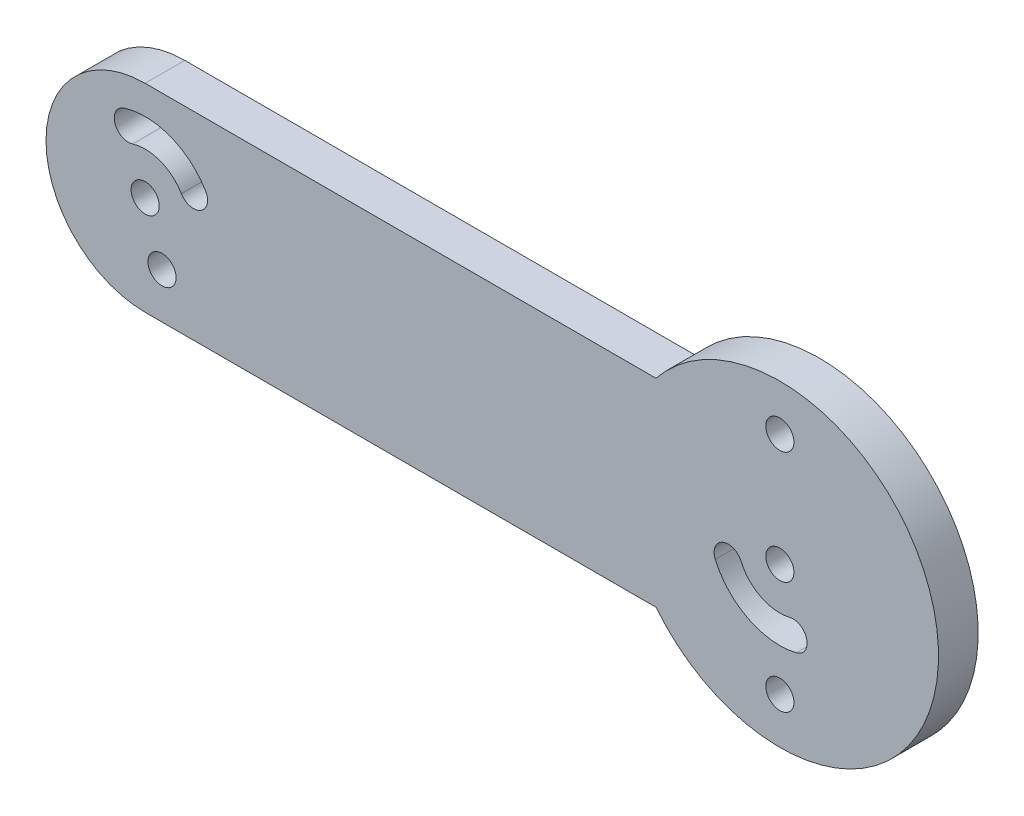
ISO-10303-21;
HEADER;
FILE_DESCRIPTION(('STEP AP214'),'2;1');
FILE_NAME('part.step','',(''),(''),'','','');
FILE_SCHEMA(('AUTOMOTIVE_DESIGN { 1 0 10303 214 1 1 1 1 }'));
ENDSEC;
DATA;
#1=APPLICATION_CONTEXT('core data for automotive mechanical design processes');
#2=APPLICATION_PROTOCOL_DEFINITION('international standard','automotive_design',2000,#1);
#3=PRODUCT_CONTEXT('',#1,'mechanical');
#4=PRODUCT('Part','Part','',(#3));
#5=PRODUCT_RELATED_PRODUCT_CATEGORY('part','',(#4));
#6=PRODUCT_DEFINITION_FORMATION('','',#4);
#7=PRODUCT_DEFINITION_CONTEXT('part definition',#1,'design');
#8=PRODUCT_DEFINITION('design','',#6,#7);
#9=PRODUCT_DEFINITION_SHAPE('','',#8);
#10=(LENGTH_UNIT() NAMED_UNIT(*) SI_UNIT(.MILLI.,.METRE.));
#11=(NAMED_UNIT(*) PLANE_ANGLE_UNIT() SI_UNIT($,.RADIAN.));
#12=(NAMED_UNIT(*) SI_UNIT($,.STERADIAN.) SOLID_ANGLE_UNIT());
#13=UNCERTAINTY_MEASURE_WITH_UNIT(LENGTH_MEASURE(1.E-05),#10,'distance_accuracy_value','');
#14=(GEOMETRIC_REPRESENTATION_CONTEXT(3) GLOBAL_UNCERTAINTY_ASSIGNED_CONTEXT((#13)) GLOBAL_UNIT_ASSIGNED_CONTEXT((#10,
#11,#12)) REPRESENTATION_CONTEXT('',''));
#15=CARTESIAN_POINT('',(0.,0.,0.));
#16=DIRECTION('',(0.,0.,1.));
#17=DIRECTION('',(1.,0.,0.));
#18=AXIS2_PLACEMENT_3D('',#15,#16,#17);
#19=CARTESIAN_POINT('',(-40.,-2.79318507107451E-13,2.5));
#20=DIRECTION('',(0.,0.,1.));
#21=DIRECTION('',(1.,0.,0.));
#22=AXIS2_PLACEMENT_3D('',#19,#20,#21);
#23=PLANE('',#22);
#24=CARTESIAN_POINT('',(0.,-7.1,2.5));
#25=DIRECTION('',(0.,0.,1.));
#26=DIRECTION('',(-1.,0.,0.));
#27=AXIS2_PLACEMENT_3D('',#24,#25,#26);
#28=CIRCLE('',#27,0.8875);
#29=CARTESIAN_POINT('',(-0.887499999999971,-7.1,2.5));
#30=VERTEX_POINT('',#29);
#31=EDGE_CURVE('E357',#30,#30,#28,.T.);
#32=ORIENTED_EDGE('',*,*,#31,.F.);
#33=EDGE_LOOP('',(#32));
#34=FACE_BOUND('',#33,.T.);
#35=CARTESIAN_POINT('',(-40.,-2.79318507107451E-13,2.5));
#36=DIRECTION('',(0.,0.,1.));
#37=DIRECTION('',(1.,0.,0.));
#38=AXIS2_PLACEMENT_3D('',#35,#36,#37);
#39=CIRCLE('',#38,4.4375);
#40=CARTESIAN_POINT('',(-36.1923943392859,2.27893514223126,2.5));
#41=VERTEX_POINT('',#40);
#42=CARTESIAN_POINT('',(-41.3271000939579,4.23440805669629,2.5));
#43=VERTEX_POINT('',#42);
#44=EDGE_CURVE('E144',#41,#43,#39,.T.);
#45=ORIENTED_EDGE('',*,*,#44,.F.);
#46=CARTESIAN_POINT('',(-36.9539154714287,1.82314811378495,2.5));
#47=DIRECTION('',(0.,0.,1.));
#48=DIRECTION('',(1.,0.,0.));
#49=AXIS2_PLACEMENT_3D('',#46,#47,#48);
#50=CIRCLE('',#49,0.887500000000004);
#51=CARTESIAN_POINT('',(-37.7154366035715,1.36736108533865,2.5));
#52=VERTEX_POINT('',#51);
#53=EDGE_CURVE('E135',#52,#41,#50,.T.);
#54=ORIENTED_EDGE('',*,*,#53,.F.);
#55=CARTESIAN_POINT('',(-40.,-2.79318507107451E-13,2.5));
#56=DIRECTION('',(0.,0.,-1.));
#57=DIRECTION('',(1.,0.,0.));
#58=AXIS2_PLACEMENT_3D('',#55,#56,#57);
#59=CIRCLE('',#58,2.66249999999999);
#60=CARTESIAN_POINT('',(-40.7962600563748,2.54064483401766,2.5));
#61=VERTEX_POINT('',#60);
#62=EDGE_CURVE('E162',#61,#52,#59,.T.);
#63=ORIENTED_EDGE('',*,*,#62,.F.);
#64=CARTESIAN_POINT('',(-41.0616800751664,3.38752644535695,2.5));
#65=DIRECTION('',(0.,0.,1.));
#66=DIRECTION('',(1.,0.,0.));
#67=AXIS2_PLACEMENT_3D('',#64,#65,#66);
#68=CIRCLE('',#67,0.887500000000001);
#69=EDGE_CURVE('E158',#43,#61,#68,.T.);
#70=ORIENTED_EDGE('',*,*,#69,.F.);
#71=EDGE_LOOP('',(#45,#54,#63,#70));
#72=FACE_BOUND('',#71,.T.);
#73=CARTESIAN_POINT('',(0.,0.,2.5));
#74=DIRECTION('',(0.,0.,1.));
#75=DIRECTION('',(1.,0.,0.));
#76=AXIS2_PLACEMENT_3D('',#73,#74,#75);
#77=CIRCLE('',#76,4.4375);
#78=CARTESIAN_POINT('',(-4.06945408008397,-1.76944899335581,2.5));
#79=VERTEX_POINT('',#78);
#80=CARTESIAN_POINT('',(1.03591380211059,-4.31489152176469,2.5));
#81=VERTEX_POINT('',#80);
#82=EDGE_CURVE('E189',#79,#81,#77,.T.);
#83=ORIENTED_EDGE('',*,*,#82,.F.);
#84=CARTESIAN_POINT('',(-3.25556326406718,-1.41555919468465,2.5));
#85=DIRECTION('',(0.,0.,1.));
#86=DIRECTION('',(1.,0.,0.));
#87=AXIS2_PLACEMENT_3D('',#84,#85,#86);
#88=CIRCLE('',#87,0.887500000000001);
#89=CARTESIAN_POINT('',(-2.44167244805038,-1.06166939601349,2.5));
#90=VERTEX_POINT('',#89);
#91=EDGE_CURVE('E186',#90,#79,#88,.T.);
#92=ORIENTED_EDGE('',*,*,#91,.F.);
#93=CARTESIAN_POINT('',(0.,0.,2.5));
#94=DIRECTION('',(0.,0.,-1.));
#95=DIRECTION('',(1.,0.,0.));
#96=AXIS2_PLACEMENT_3D('',#93,#94,#95);
#97=CIRCLE('',#96,2.6625);
#98=CARTESIAN_POINT('',(0.621548281266353,-2.58893491305881,2.5));
#99=VERTEX_POINT('',#98);
#100=EDGE_CURVE('E197',#99,#90,#97,.T.);
#101=ORIENTED_EDGE('',*,*,#100,.F.);
#102=CARTESIAN_POINT('',(0.828731041688472,-3.45191321741175,2.5));
#103=DIRECTION('',(0.,0.,1.));
#104=DIRECTION('',(1.,0.,0.));
#105=AXIS2_PLACEMENT_3D('',#102,#103,#104);
#106=CIRCLE('',#105,0.8875);
#107=EDGE_CURVE('E193',#81,#99,#106,.T.);
#108=ORIENTED_EDGE('',*,*,#107,.F.);
#109=EDGE_LOOP('',(#83,#92,#101,#108));
#110=FACE_BOUND('',#109,.T.);
#111=CARTESIAN_POINT('',(-40.,-2.79318507107451E-13,2.5));
#112=DIRECTION('',(0.,0.,1.));
#113=DIRECTION('',(1.,0.,0.));
#114=AXIS2_PLACEMENT_3D('',#111,#112,#113);
#115=CIRCLE('',#114,0.887499999999998);
#116=CARTESIAN_POINT('',(-39.1125,-2.79318507107451E-13,2.5));
#117=VERTEX_POINT('',#116);
#118=EDGE_CURVE('E229',#117,#117,#115,.T.);
#119=ORIENTED_EDGE('',*,*,#118,.F.);
#120=EDGE_LOOP('',(#119));
#121=FACE_BOUND('',#120,.T.);
#122=CARTESIAN_POINT('',(-40.,-2.79318507107451E-13,2.5));
#123=DIRECTION('',(0.,0.,1.));
#124=DIRECTION('',(1.,0.,0.));
#125=AXIS2_PLACEMENT_3D('',#122,#123,#124);
#126=CIRCLE('',#125,6.25000000000014);
#127=CARTESIAN_POINT('',(-40.,6.25000000000014,2.5));
#128=VERTEX_POINT('',#127);
#129=CARTESIAN_POINT('',(-40.,-6.25000000000014,2.5));
#130=VERTEX_POINT('',#129);
#131=EDGE_CURVE('E245',#128,#130,#126,.T.);
#132=ORIENTED_EDGE('',*,*,#131,.T.);
#133=DIRECTION('',(1.,0.,0.));
#134=VECTOR('',#133,1.);
#135=CARTESIAN_POINT('',(-40.,-6.25000000000014,2.5));
#136=LINE('',#135,#134);
#137=CARTESIAN_POINT('',(-7.80624749799789,-6.25000000000014,2.5));
#138=VERTEX_POINT('',#137);
#139=EDGE_CURVE('E249',#130,#138,#136,.T.);
#140=ORIENTED_EDGE('',*,*,#139,.T.);
#141=CARTESIAN_POINT('',(0.,0.,2.5));
#142=DIRECTION('',(0.,0.,1.));
#143=DIRECTION('',(1.,0.,0.));
#144=AXIS2_PLACEMENT_3D('',#141,#142,#143);
#145=CIRCLE('',#144,10.);
#146=CARTESIAN_POINT('',(-7.80624749799789,6.25000000000014,2.5));
#147=VERTEX_POINT('',#146);
#148=EDGE_CURVE('E253',#138,#147,#145,.T.);
#149=ORIENTED_EDGE('',*,*,#148,.T.);
#150=DIRECTION('',(-1.,0.,0.));
#151=VECTOR('',#150,1.);
#152=CARTESIAN_POINT('',(-40.,6.25000000000014,2.5));
#153=LINE('',#152,#151);
#154=EDGE_CURVE('E256',#147,#128,#153,.T.);
#155=ORIENTED_EDGE('',*,*,#154,.T.);
#156=EDGE_LOOP('',(#132,#140,#149,#155));
#157=FACE_BOUND('',#156,.T.);
#158=CARTESIAN_POINT('',(0.,0.,2.5));
#159=DIRECTION('',(0.,0.,1.));
#160=DIRECTION('',(1.,0.,0.));
#161=AXIS2_PLACEMENT_3D('',#158,#159,#160);
#162=CIRCLE('',#161,0.8875);
#163=CARTESIAN_POINT('',(0.8875,0.,2.5));
#164=VERTEX_POINT('',#163);
#165=EDGE_CURVE('E237',#164,#164,#162,.T.);
#166=ORIENTED_EDGE('',*,*,#165,.F.);
#167=EDGE_LOOP('',(#166));
#168=FACE_BOUND('',#167,.T.);
#169=CARTESIAN_POINT('',(0.,7.1,2.5));
#170=DIRECTION('',(0.,0.,1.));
#171=DIRECTION('',(1.,0.,0.));
#172=AXIS2_PLACEMENT_3D('',#169,#170,#171);
#173=CIRCLE('',#172,0.887500000000001);
#174=CARTESIAN_POINT('',(0.887499999999973,7.1,2.5));
#175=VERTEX_POINT('',#174);
#176=EDGE_CURVE('E170',#175,#175,#173,.T.);
#177=ORIENTED_EDGE('',*,*,#176,.F.);
#178=EDGE_LOOP('',(#177));
#179=FACE_BOUND('',#178,.T.);
#180=CARTESIAN_POINT('',(-38.9383199248337,-3.38752644535754,2.5));
#181=DIRECTION('',(0.,0.,1.));
#182=DIRECTION('',(1.,0.,0.));
#183=AXIS2_PLACEMENT_3D('',#180,#181,#182);
#184=CIRCLE('',#183,0.887499999999998);
#185=CARTESIAN_POINT('',(-38.0508199248337,-3.38752644535754,2.5));
#186=VERTEX_POINT('',#185);
#187=EDGE_CURVE('E351',#186,#186,#184,.T.);
#188=ORIENTED_EDGE('',*,*,#187,.F.);
#189=EDGE_LOOP('',(#188));
#190=FACE_BOUND('',#189,.T.);
#191=ADVANCED_FACE('F45',(#34,#72,#110,#121,#157,#168,#179,#190),#23,.T.);
#192=CARTESIAN_POINT('',(-40.,-2.79318507107451E-13,0.));
#193=DIRECTION('',(0.,0.,1.));
#194=DIRECTION('',(1.,0.,0.));
#195=AXIS2_PLACEMENT_3D('',#192,#193,#194);
#196=PLANE('',#195);
#197=CARTESIAN_POINT('',(-3.25556326406718,-1.41555919468465,0.));
#198=DIRECTION('',(0.,0.,1.));
#199=DIRECTION('',(1.,0.,0.));
#200=AXIS2_PLACEMENT_3D('',#197,#198,#199);
#201=CIRCLE('',#200,0.887500000000001);
#202=CARTESIAN_POINT('',(-2.44167244805038,-1.06166939601349,0.));
#203=VERTEX_POINT('',#202);
#204=CARTESIAN_POINT('',(-4.06945408008397,-1.76944899335581,0.));
#205=VERTEX_POINT('',#204);
#206=EDGE_CURVE('E153',#203,#205,#201,.T.);
#207=ORIENTED_EDGE('',*,*,#206,.T.);
#208=CARTESIAN_POINT('',(0.,0.,0.));
#209=DIRECTION('',(0.,0.,1.));
#210=DIRECTION('',(1.,0.,0.));
#211=AXIS2_PLACEMENT_3D('',#208,#209,#210);
#212=CIRCLE('',#211,4.4375);
#213=CARTESIAN_POINT('',(1.03591380211059,-4.31489152176469,0.));
#214=VERTEX_POINT('',#213);
#215=EDGE_CURVE('E204',#205,#214,#212,.T.);
#216=ORIENTED_EDGE('',*,*,#215,.T.);
#217=CARTESIAN_POINT('',(0.828731041688472,-3.45191321741175,0.));
#218=DIRECTION('',(0.,0.,1.));
#219=DIRECTION('',(1.,0.,0.));
#220=AXIS2_PLACEMENT_3D('',#217,#218,#219);
#221=CIRCLE('',#220,0.8875);
#222=CARTESIAN_POINT('',(0.621548281266353,-2.58893491305881,0.));
#223=VERTEX_POINT('',#222);
#224=EDGE_CURVE('E208',#214,#223,#221,.T.);
#225=ORIENTED_EDGE('',*,*,#224,.T.);
#226=CARTESIAN_POINT('',(0.,0.,0.));
#227=DIRECTION('',(0.,0.,-1.));
#228=DIRECTION('',(1.,0.,0.));
#229=AXIS2_PLACEMENT_3D('',#226,#227,#228);
#230=CIRCLE('',#229,2.6625);
#231=EDGE_CURVE('E190',#223,#203,#230,.T.);
#232=ORIENTED_EDGE('',*,*,#231,.T.);
#233=EDGE_LOOP('',(#207,#216,#225,#232));
#234=FACE_BOUND('',#233,.T.);
#235=CARTESIAN_POINT('',(-40.,-2.79318507107451E-13,0.));
#236=DIRECTION('',(0.,0.,1.));
#237=DIRECTION('',(1.,0.,0.));
#238=AXIS2_PLACEMENT_3D('',#235,#236,#237);
#239=CIRCLE('',#238,6.25000000000014);
#240=CARTESIAN_POINT('',(-40.,6.25000000000014,0.));
#241=VERTEX_POINT('',#240);
#242=CARTESIAN_POINT('',(-40.,-6.25000000000014,0.));
#243=VERTEX_POINT('',#242);
#244=EDGE_CURVE('E241',#241,#243,#239,.T.);
#245=ORIENTED_EDGE('',*,*,#244,.F.);
#246=DIRECTION('',(-1.,0.,0.));
#247=VECTOR('',#246,1.);
#248=CARTESIAN_POINT('',(-40.,6.25000000000014,0.));
#249=LINE('',#248,#247);
#250=CARTESIAN_POINT('',(-7.80624749799789,6.25000000000014,0.));
#251=VERTEX_POINT('',#250);
#252=EDGE_CURVE('E250',#251,#241,#249,.T.);
#253=ORIENTED_EDGE('',*,*,#252,.F.);
#254=CARTESIAN_POINT('',(0.,0.,0.));
#255=DIRECTION('',(0.,0.,1.));
#256=DIRECTION('',(1.,0.,0.));
#257=AXIS2_PLACEMENT_3D('',#254,#255,#256);
#258=CIRCLE('',#257,10.);
#259=CARTESIAN_POINT('',(-7.80624749799789,-6.25000000000014,0.));
#260=VERTEX_POINT('',#259);
#261=EDGE_CURVE('E266',#260,#251,#258,.T.);
#262=ORIENTED_EDGE('',*,*,#261,.F.);
#263=DIRECTION('',(1.,0.,0.));
#264=VECTOR('',#263,1.);
#265=CARTESIAN_POINT('',(-40.,-6.25000000000014,0.));
#266=LINE('',#265,#264);
#267=EDGE_CURVE('E263',#243,#260,#266,.T.);
#268=ORIENTED_EDGE('',*,*,#267,.F.);
#269=EDGE_LOOP('',(#245,#253,#262,#268));
#270=FACE_BOUND('',#269,.T.);
#271=CARTESIAN_POINT('',(0.,0.,0.));
#272=DIRECTION('',(0.,0.,1.));
#273=DIRECTION('',(1.,0.,0.));
#274=AXIS2_PLACEMENT_3D('',#271,#272,#273);
#275=CIRCLE('',#274,0.8875);
#276=CARTESIAN_POINT('',(0.8875,0.,0.));
#277=VERTEX_POINT('',#276);
#278=EDGE_CURVE('E233',#277,#277,#275,.T.);
#279=ORIENTED_EDGE('',*,*,#278,.T.);
#280=EDGE_LOOP('',(#279));
#281=FACE_BOUND('',#280,.T.);
#282=CARTESIAN_POINT('',(-40.,-2.79318507107451E-13,0.));
#283=DIRECTION('',(0.,0.,1.));
#284=DIRECTION('',(1.,0.,0.));
#285=AXIS2_PLACEMENT_3D('',#282,#283,#284);
#286=CIRCLE('',#285,0.887499999999998);
#287=CARTESIAN_POINT('',(-39.1125,-2.79318507107451E-13,0.));
#288=VERTEX_POINT('',#287);
#289=EDGE_CURVE('E228',#288,#288,#286,.T.);
#290=ORIENTED_EDGE('',*,*,#289,.T.);
#291=EDGE_LOOP('',(#290));
#292=FACE_BOUND('',#291,.T.);
#293=CARTESIAN_POINT('',(-36.9539154714287,1.82314811378495,0.));
#294=DIRECTION('',(0.,0.,1.));
#295=DIRECTION('',(1.,0.,0.));
#296=AXIS2_PLACEMENT_3D('',#293,#294,#295);
#297=CIRCLE('',#296,0.887500000000004);
#298=CARTESIAN_POINT('',(-37.7154366035715,1.36736108533865,0.));
#299=VERTEX_POINT('',#298);
#300=CARTESIAN_POINT('',(-36.1923943392859,2.27893514223126,0.));
#301=VERTEX_POINT('',#300);
#302=EDGE_CURVE('E69',#299,#301,#297,.T.);
#303=ORIENTED_EDGE('',*,*,#302,.T.);
#304=CARTESIAN_POINT('',(-40.,-2.79318507107451E-13,0.));
#305=DIRECTION('',(0.,0.,1.));
#306=DIRECTION('',(1.,0.,0.));
#307=AXIS2_PLACEMENT_3D('',#304,#305,#306);
#308=CIRCLE('',#307,4.4375);
#309=CARTESIAN_POINT('',(-41.3271000939579,4.23440805669629,0.));
#310=VERTEX_POINT('',#309);
#311=EDGE_CURVE('E151',#301,#310,#308,.T.);
#312=ORIENTED_EDGE('',*,*,#311,.T.);
#313=CARTESIAN_POINT('',(-41.0616800751664,3.38752644535695,0.));
#314=DIRECTION('',(0.,0.,1.));
#315=DIRECTION('',(1.,0.,0.));
#316=AXIS2_PLACEMENT_3D('',#313,#314,#315);
#317=CIRCLE('',#316,0.887500000000001);
#318=CARTESIAN_POINT('',(-40.7962600563748,2.54064483401766,0.));
#319=VERTEX_POINT('',#318);
#320=EDGE_CURVE('E173',#310,#319,#317,.T.);
#321=ORIENTED_EDGE('',*,*,#320,.T.);
#322=CARTESIAN_POINT('',(-40.,-2.79318507107451E-13,0.));
#323=DIRECTION('',(0.,0.,-1.));
#324=DIRECTION('',(1.,0.,0.));
#325=AXIS2_PLACEMENT_3D('',#322,#323,#324);
#326=CIRCLE('',#325,2.66249999999999);
#327=EDGE_CURVE('E145',#319,#299,#326,.T.);
#328=ORIENTED_EDGE('',*,*,#327,.T.);
#329=EDGE_LOOP('',(#303,#312,#321,#328));
#330=FACE_BOUND('',#329,.T.);
#331=CARTESIAN_POINT('',(0.,7.1,0.));
#332=DIRECTION('',(0.,0.,1.));
#333=DIRECTION('',(1.,0.,0.));
#334=AXIS2_PLACEMENT_3D('',#331,#332,#333);
#335=CIRCLE('',#334,0.887500000000001);
#336=CARTESIAN_POINT('',(0.887499999999973,7.1,0.));
#337=VERTEX_POINT('',#336);
#338=EDGE_CURVE('E341',#337,#337,#335,.T.);
#339=ORIENTED_EDGE('',*,*,#338,.T.);
#340=EDGE_LOOP('',(#339));
#341=FACE_BOUND('',#340,.T.);
#342=CARTESIAN_POINT('',(0.,-7.1,0.));
#343=DIRECTION('',(0.,0.,1.));
#344=DIRECTION('',(-1.,0.,0.));
#345=AXIS2_PLACEMENT_3D('',#342,#343,#344);
#346=CIRCLE('',#345,0.8875);
#347=CARTESIAN_POINT('',(-0.887499999999971,-7.1,0.));
#348=VERTEX_POINT('',#347);
#349=EDGE_CURVE('E345',#348,#348,#346,.T.);
#350=ORIENTED_EDGE('',*,*,#349,.T.);
#351=EDGE_LOOP('',(#350));
#352=FACE_BOUND('',#351,.T.);
#353=CARTESIAN_POINT('',(-38.9383199248337,-3.38752644535754,0.));
#354=DIRECTION('',(0.,0.,1.));
#355=DIRECTION('',(1.,0.,0.));
#356=AXIS2_PLACEMENT_3D('',#353,#354,#355);
#357=CIRCLE('',#356,0.887499999999998);
#358=CARTESIAN_POINT('',(-38.0508199248337,-3.38752644535754,0.));
#359=VERTEX_POINT('',#358);
#360=EDGE_CURVE('E348',#359,#359,#357,.T.);
#361=ORIENTED_EDGE('',*,*,#360,.T.);
#362=EDGE_LOOP('',(#361));
#363=FACE_BOUND('',#362,.T.);
#364=ADVANCED_FACE('F289',(#234,#270,#281,#292,#330,#341,#352,#363),#196,.F.);
#365=CARTESIAN_POINT('',(-40.,-2.79318507107451E-13,2.5));
#366=DIRECTION('',(0.,0.,-1.));
#367=DIRECTION('',(-1.,0.,0.));
#368=AXIS2_PLACEMENT_3D('',#365,#366,#367);
#369=CYLINDRICAL_SURFACE('',#368,6.25000000000014);
#370=ORIENTED_EDGE('',*,*,#244,.T.);
#371=DIRECTION('',(0.,0.,-1.));
#372=VECTOR('',#371,1.);
#373=CARTESIAN_POINT('',(-40.,-6.25000000000014,2.5));
#374=LINE('',#373,#372);
#375=EDGE_CURVE('E11',#130,#243,#374,.T.);
#376=ORIENTED_EDGE('',*,*,#375,.F.);
#377=ORIENTED_EDGE('',*,*,#131,.F.);
#378=DIRECTION('',(0.,0.,-1.));
#379=VECTOR('',#378,1.);
#380=CARTESIAN_POINT('',(-40.,6.25000000000014,2.5));
#381=LINE('',#380,#379);
#382=EDGE_CURVE('E259',#128,#241,#381,.T.);
#383=ORIENTED_EDGE('',*,*,#382,.T.);
#384=EDGE_LOOP('',(#370,#376,#377,#383));
#385=FACE_BOUND('',#384,.T.);
#386=ADVANCED_FACE('F47',(#385),#369,.T.);
#387=CARTESIAN_POINT('',(-40.,-6.25000000000014,2.5));
#388=DIRECTION('',(0.,1.,0.));
#389=DIRECTION('',(-1.,0.,0.));
#390=AXIS2_PLACEMENT_3D('',#387,#388,#389);
#391=PLANE('',#390);
#392=ORIENTED_EDGE('',*,*,#267,.T.);
#393=DIRECTION('',(0.,0.,-1.));
#394=VECTOR('',#393,1.);
#395=CARTESIAN_POINT('',(-7.80624749799789,-6.25000000000014,2.5));
#396=LINE('',#395,#394);
#397=EDGE_CURVE('E54',#138,#260,#396,.T.);
#398=ORIENTED_EDGE('',*,*,#397,.F.);
#399=ORIENTED_EDGE('',*,*,#139,.F.);
#400=ORIENTED_EDGE('',*,*,#375,.T.);
#401=EDGE_LOOP('',(#392,#398,#399,#400));
#402=FACE_BOUND('',#401,.T.);
#403=ADVANCED_FACE('F300',(#402),#391,.F.);
#404=CARTESIAN_POINT('',(0.,0.,2.5));
#405=DIRECTION('',(0.,0.,-1.));
#406=DIRECTION('',(-1.,0.,0.));
#407=AXIS2_PLACEMENT_3D('',#404,#405,#406);
#408=CYLINDRICAL_SURFACE('',#407,10.);
#409=ORIENTED_EDGE('',*,*,#261,.T.);
#410=DIRECTION('',(0.,0.,-1.));
#411=VECTOR('',#410,1.);
#412=CARTESIAN_POINT('',(-7.80624749799789,6.25000000000014,2.5));
#413=LINE('',#412,#411);
#414=EDGE_CURVE('E274',#147,#251,#413,.T.);
#415=ORIENTED_EDGE('',*,*,#414,.F.);
#416=ORIENTED_EDGE('',*,*,#148,.F.);
#417=ORIENTED_EDGE('',*,*,#397,.T.);
#418=EDGE_LOOP('',(#409,#415,#416,#417));
#419=FACE_BOUND('',#418,.T.);
#420=ADVANCED_FACE('F283',(#419),#408,.T.);
#421=CARTESIAN_POINT('',(-40.,6.25000000000014,2.5));
#422=DIRECTION('',(0.,-1.,0.));
#423=DIRECTION('',(1.,0.,0.));
#424=AXIS2_PLACEMENT_3D('',#421,#422,#423);
#425=PLANE('',#424);
#426=ORIENTED_EDGE('',*,*,#252,.T.);
#427=ORIENTED_EDGE('',*,*,#382,.F.);
#428=ORIENTED_EDGE('',*,*,#154,.F.);
#429=ORIENTED_EDGE('',*,*,#414,.T.);
#430=EDGE_LOOP('',(#426,#427,#428,#429));
#431=FACE_BOUND('',#430,.T.);
#432=ADVANCED_FACE('F293',(#431),#425,.F.);
#433=CARTESIAN_POINT('',(0.,0.,2.5));
#434=DIRECTION('',(0.,0.,-1.));
#435=DIRECTION('',(-1.,0.,0.));
#436=AXIS2_PLACEMENT_3D('',#433,#434,#435);
#437=CYLINDRICAL_SURFACE('',#436,0.8875);
#438=ORIENTED_EDGE('',*,*,#165,.T.);
#439=EDGE_LOOP('',(#438));
#440=FACE_BOUND('',#439,.T.);
#441=ORIENTED_EDGE('',*,*,#278,.F.);
#442=EDGE_LOOP('',(#441));
#443=FACE_BOUND('',#442,.T.);
#444=ADVANCED_FACE('F317',(#440,#443),#437,.F.);
#445=CARTESIAN_POINT('',(-40.,-2.79318507107451E-13,2.5));
#446=DIRECTION('',(0.,0.,-1.));
#447=DIRECTION('',(-1.,0.,0.));
#448=AXIS2_PLACEMENT_3D('',#445,#446,#447);
#449=CYLINDRICAL_SURFACE('',#448,0.887499999999998);
#450=ORIENTED_EDGE('',*,*,#118,.T.);
#451=EDGE_LOOP('',(#450));
#452=FACE_BOUND('',#451,.T.);
#453=ORIENTED_EDGE('',*,*,#289,.F.);
#454=EDGE_LOOP('',(#453));
#455=FACE_BOUND('',#454,.T.);
#456=ADVANCED_FACE('F324',(#452,#455),#449,.F.);
#457=CARTESIAN_POINT('',(-3.25556326406718,-1.41555919468465,2.5));
#458=DIRECTION('',(0.,0.,-1.));
#459=DIRECTION('',(-1.,0.,0.));
#460=AXIS2_PLACEMENT_3D('',#457,#458,#459);
#461=CYLINDRICAL_SURFACE('',#460,0.887500000000001);
#462=ORIENTED_EDGE('',*,*,#206,.F.);
#463=DIRECTION('',(0.,0.,-1.));
#464=VECTOR('',#463,1.);
#465=CARTESIAN_POINT('',(-2.44167244805038,-1.06166939601349,2.5));
#466=LINE('',#465,#464);
#467=EDGE_CURVE('E200',#90,#203,#466,.T.);
#468=ORIENTED_EDGE('',*,*,#467,.F.);
#469=ORIENTED_EDGE('',*,*,#91,.T.);
#470=DIRECTION('',(0.,0.,-1.));
#471=VECTOR('',#470,1.);
#472=CARTESIAN_POINT('',(-4.06945408008397,-1.76944899335581,2.5));
#473=LINE('',#472,#471);
#474=EDGE_CURVE('E224',#79,#205,#473,.T.);
#475=ORIENTED_EDGE('',*,*,#474,.T.);
#476=EDGE_LOOP('',(#462,#468,#469,#475));
#477=FACE_BOUND('',#476,.T.);
#478=ADVANCED_FACE('F329',(#477),#461,.F.);
#479=CARTESIAN_POINT('',(0.,0.,2.5));
#480=DIRECTION('',(0.,0.,-1.));
#481=DIRECTION('',(-1.,0.,0.));
#482=AXIS2_PLACEMENT_3D('',#479,#480,#481);
#483=CYLINDRICAL_SURFACE('',#482,4.4375);
#484=ORIENTED_EDGE('',*,*,#215,.F.);
#485=ORIENTED_EDGE('',*,*,#474,.F.);
#486=ORIENTED_EDGE('',*,*,#82,.T.);
#487=DIRECTION('',(0.,0.,-1.));
#488=VECTOR('',#487,1.);
#489=CARTESIAN_POINT('',(1.03591380211059,-4.31489152176469,2.5));
#490=LINE('',#489,#488);
#491=EDGE_CURVE('E221',#81,#214,#490,.T.);
#492=ORIENTED_EDGE('',*,*,#491,.T.);
#493=EDGE_LOOP('',(#484,#485,#486,#492));
#494=FACE_BOUND('',#493,.T.);
#495=ADVANCED_FACE('F404',(#494),#483,.F.);
#496=CARTESIAN_POINT('',(0.828731041688472,-3.45191321741175,2.5));
#497=DIRECTION('',(0.,0.,-1.));
#498=DIRECTION('',(-1.,0.,0.));
#499=AXIS2_PLACEMENT_3D('',#496,#497,#498);
#500=CYLINDRICAL_SURFACE('',#499,0.8875);
#501=ORIENTED_EDGE('',*,*,#224,.F.);
#502=ORIENTED_EDGE('',*,*,#491,.F.);
#503=ORIENTED_EDGE('',*,*,#107,.T.);
#504=DIRECTION('',(0.,0.,-1.));
#505=VECTOR('',#504,1.);
#506=CARTESIAN_POINT('',(0.621548281266353,-2.58893491305881,2.5));
#507=LINE('',#506,#505);
#508=EDGE_CURVE('E218',#99,#223,#507,.T.);
#509=ORIENTED_EDGE('',*,*,#508,.T.);
#510=EDGE_LOOP('',(#501,#502,#503,#509));
#511=FACE_BOUND('',#510,.T.);
#512=ADVANCED_FACE('F400',(#511),#500,.F.);
#513=CARTESIAN_POINT('',(0.,0.,2.5));
#514=DIRECTION('',(0.,0.,-1.));
#515=DIRECTION('',(-1.,0.,0.));
#516=AXIS2_PLACEMENT_3D('',#513,#514,#515);
#517=CYLINDRICAL_SURFACE('',#516,2.6625);
#518=ORIENTED_EDGE('',*,*,#231,.F.);
#519=ORIENTED_EDGE('',*,*,#508,.F.);
#520=ORIENTED_EDGE('',*,*,#100,.T.);
#521=ORIENTED_EDGE('',*,*,#467,.T.);
#522=EDGE_LOOP('',(#518,#519,#520,#521));
#523=FACE_BOUND('',#522,.T.);
#524=ADVANCED_FACE('F397',(#523),#517,.T.);
#525=CARTESIAN_POINT('',(-36.9539154714287,1.82314811378495,2.5));
#526=DIRECTION('',(0.,0.,-1.));
#527=DIRECTION('',(-1.,0.,0.));
#528=AXIS2_PLACEMENT_3D('',#525,#526,#527);
#529=CYLINDRICAL_SURFACE('',#528,0.887500000000004);
#530=ORIENTED_EDGE('',*,*,#302,.F.);
#531=DIRECTION('',(0.,0.,-1.));
#532=VECTOR('',#531,1.);
#533=CARTESIAN_POINT('',(-37.7154366035715,1.36736108533865,2.5));
#534=LINE('',#533,#532);
#535=EDGE_CURVE('E139',#52,#299,#534,.T.);
#536=ORIENTED_EDGE('',*,*,#535,.F.);
#537=ORIENTED_EDGE('',*,*,#53,.T.);
#538=DIRECTION('',(0.,0.,-1.));
#539=VECTOR('',#538,1.);
#540=CARTESIAN_POINT('',(-36.1923943392859,2.27893514223126,2.5));
#541=LINE('',#540,#539);
#542=EDGE_CURVE('E138',#41,#301,#541,.T.);
#543=ORIENTED_EDGE('',*,*,#542,.T.);
#544=EDGE_LOOP('',(#530,#536,#537,#543));
#545=FACE_BOUND('',#544,.T.);
#546=ADVANCED_FACE('F137',(#545),#529,.F.);
#547=CARTESIAN_POINT('',(-40.,-2.79318507107451E-13,2.5));
#548=DIRECTION('',(0.,0.,-1.));
#549=DIRECTION('',(-1.,0.,0.));
#550=AXIS2_PLACEMENT_3D('',#547,#548,#549);
#551=CYLINDRICAL_SURFACE('',#550,4.4375);
#552=ORIENTED_EDGE('',*,*,#311,.F.);
#553=ORIENTED_EDGE('',*,*,#542,.F.);
#554=ORIENTED_EDGE('',*,*,#44,.T.);
#555=DIRECTION('',(0.,0.,-1.));
#556=VECTOR('',#555,1.);
#557=CARTESIAN_POINT('',(-41.3271000939579,4.23440805669629,2.5));
#558=LINE('',#557,#556);
#559=EDGE_CURVE('E154',#43,#310,#558,.T.);
#560=ORIENTED_EDGE('',*,*,#559,.T.);
#561=EDGE_LOOP('',(#552,#553,#554,#560));
#562=FACE_BOUND('',#561,.T.);
#563=ADVANCED_FACE('F148',(#562),#551,.F.);
#564=CARTESIAN_POINT('',(-41.0616800751664,3.38752644535695,2.5));
#565=DIRECTION('',(0.,0.,-1.));
#566=DIRECTION('',(-1.,0.,0.));
#567=AXIS2_PLACEMENT_3D('',#564,#565,#566);
#568=CYLINDRICAL_SURFACE('',#567,0.887500000000001);
#569=ORIENTED_EDGE('',*,*,#320,.F.);
#570=ORIENTED_EDGE('',*,*,#559,.F.);
#571=ORIENTED_EDGE('',*,*,#69,.T.);
#572=DIRECTION('',(0.,0.,-1.));
#573=VECTOR('',#572,1.);
#574=CARTESIAN_POINT('',(-40.7962600563748,2.54064483401766,2.5));
#575=LINE('',#574,#573);
#576=EDGE_CURVE('E61',#61,#319,#575,.T.);
#577=ORIENTED_EDGE('',*,*,#576,.T.);
#578=EDGE_LOOP('',(#569,#570,#571,#577));
#579=FACE_BOUND('',#578,.T.);
#580=ADVANCED_FACE('F389',(#579),#568,.F.);
#581=CARTESIAN_POINT('',(-40.,-2.79318507107451E-13,2.5));
#582=DIRECTION('',(0.,0.,-1.));
#583=DIRECTION('',(-1.,0.,0.));
#584=AXIS2_PLACEMENT_3D('',#581,#582,#583);
#585=CYLINDRICAL_SURFACE('',#584,2.66249999999999);
#586=ORIENTED_EDGE('',*,*,#327,.F.);
#587=ORIENTED_EDGE('',*,*,#576,.F.);
#588=ORIENTED_EDGE('',*,*,#62,.T.);
#589=ORIENTED_EDGE('',*,*,#535,.T.);
#590=EDGE_LOOP('',(#586,#587,#588,#589));
#591=FACE_BOUND('',#590,.T.);
#592=ADVANCED_FACE('F386',(#591),#585,.T.);
#593=CARTESIAN_POINT('',(0.,7.1,2.5));
#594=DIRECTION('',(0.,0.,-1.));
#595=DIRECTION('',(-1.,0.,0.));
#596=AXIS2_PLACEMENT_3D('',#593,#594,#595);
#597=CYLINDRICAL_SURFACE('',#596,0.887500000000001);
#598=ORIENTED_EDGE('',*,*,#176,.T.);
#599=EDGE_LOOP('',(#598));
#600=FACE_BOUND('',#599,.T.);
#601=ORIENTED_EDGE('',*,*,#338,.F.);
#602=EDGE_LOOP('',(#601));
#603=FACE_BOUND('',#602,.T.);
#604=ADVANCED_FACE('F368',(#600,#603),#597,.F.);
#605=CARTESIAN_POINT('',(0.,-7.1,2.5));
#606=DIRECTION('',(0.,0.,-1.));
#607=DIRECTION('',(-1.,0.,0.));
#608=AXIS2_PLACEMENT_3D('',#605,#606,#607);
#609=CYLINDRICAL_SURFACE('',#608,0.8875);
#610=ORIENTED_EDGE('',*,*,#31,.T.);
#611=EDGE_LOOP('',(#610));
#612=FACE_BOUND('',#611,.T.);
#613=ORIENTED_EDGE('',*,*,#349,.F.);
#614=EDGE_LOOP('',(#613));
#615=FACE_BOUND('',#614,.T.);
#616=ADVANCED_FACE('F376',(#612,#615),#609,.F.);
#617=CARTESIAN_POINT('',(-38.9383199248337,-3.38752644535754,2.5));
#618=DIRECTION('',(0.,0.,-1.));
#619=DIRECTION('',(-1.,0.,0.));
#620=AXIS2_PLACEMENT_3D('',#617,#618,#619);
#621=CYLINDRICAL_SURFACE('',#620,0.887499999999998);
#622=ORIENTED_EDGE('',*,*,#187,.T.);
#623=EDGE_LOOP('',(#622));
#624=FACE_BOUND('',#623,.T.);
#625=ORIENTED_EDGE('',*,*,#360,.F.);
#626=EDGE_LOOP('',(#625));
#627=FACE_BOUND('',#626,.T.);
#628=ADVANCED_FACE('F374',(#624,#627),#621,.F.);
#629=CLOSED_SHELL('',(#191,#364,#386,#403,#420,#432,#444,#456,#478,#495,#512,#524,#546,#563,
#580,#592,#604,#616,#628));
#630=MANIFOLD_SOLID_BREP('B2',#629);
#631=ADVANCED_BREP_SHAPE_REPRESENTATION('',(#18,#630),#14);
#632=SHAPE_DEFINITION_REPRESENTATION(#9,#631);
ENDSEC;
END-ISO-10303-21;
